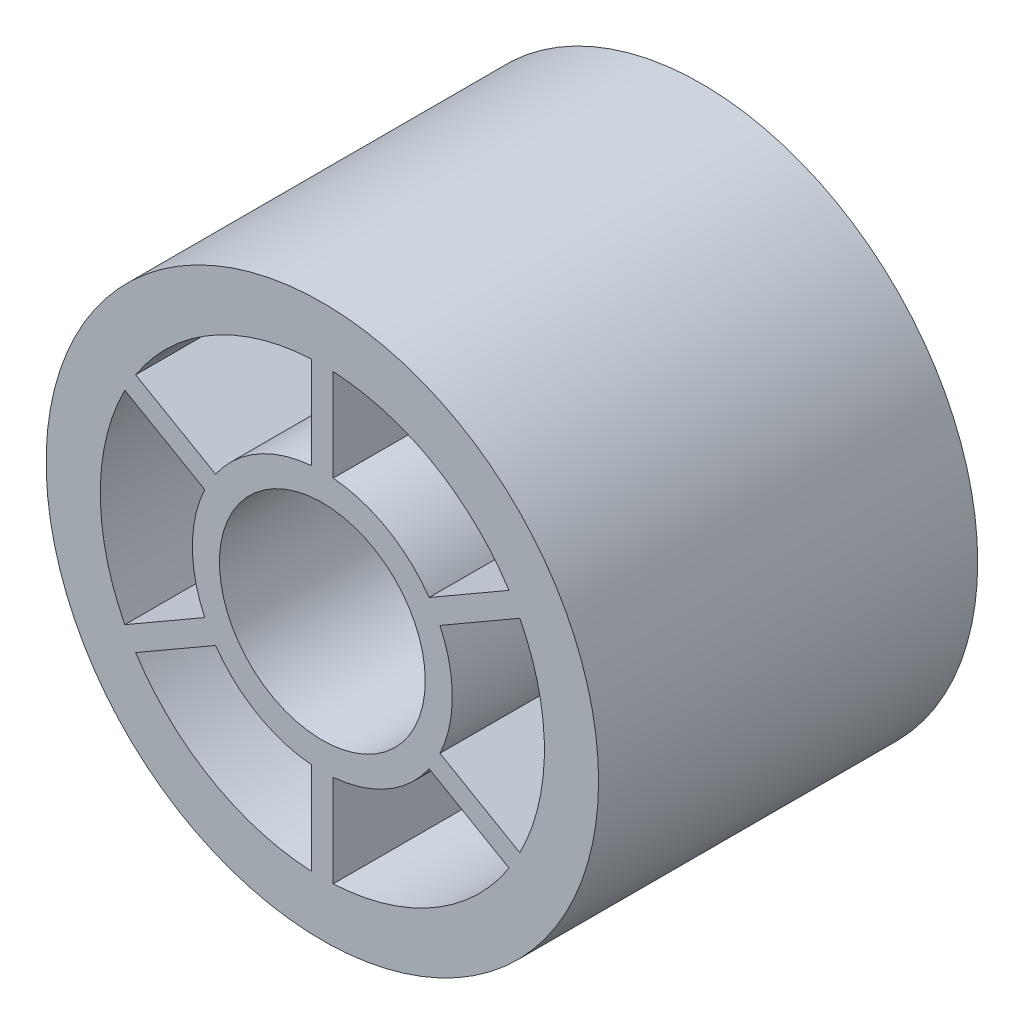
ISO-10303-21;
HEADER;
FILE_DESCRIPTION(('STEP AP214'),'2;1');
FILE_NAME('part.step','',(''),(''),'','','');
FILE_SCHEMA(('AUTOMOTIVE_DESIGN { 1 0 10303 214 1 1 1 1 }'));
ENDSEC;
DATA;
#1=APPLICATION_CONTEXT('core data for automotive mechanical design processes');
#2=APPLICATION_PROTOCOL_DEFINITION('international standard','automotive_design',2000,#1);
#3=PRODUCT_CONTEXT('',#1,'mechanical');
#4=PRODUCT('Part','Part','',(#3));
#5=PRODUCT_RELATED_PRODUCT_CATEGORY('part','',(#4));
#6=PRODUCT_DEFINITION_FORMATION('','',#4);
#7=PRODUCT_DEFINITION_CONTEXT('part definition',#1,'design');
#8=PRODUCT_DEFINITION('design','',#6,#7);
#9=PRODUCT_DEFINITION_SHAPE('','',#8);
#10=(LENGTH_UNIT() NAMED_UNIT(*) SI_UNIT(.MILLI.,.METRE.));
#11=(NAMED_UNIT(*) PLANE_ANGLE_UNIT() SI_UNIT($,.RADIAN.));
#12=(NAMED_UNIT(*) SI_UNIT($,.STERADIAN.) SOLID_ANGLE_UNIT());
#13=UNCERTAINTY_MEASURE_WITH_UNIT(LENGTH_MEASURE(1.E-05),#10,'distance_accuracy_value','');
#14=(GEOMETRIC_REPRESENTATION_CONTEXT(3) GLOBAL_UNCERTAINTY_ASSIGNED_CONTEXT((#13)) GLOBAL_UNIT_ASSIGNED_CONTEXT((#10,
#11,#12)) REPRESENTATION_CONTEXT('',''));
#15=CARTESIAN_POINT('',(0.,0.,0.));
#16=DIRECTION('',(0.,0.,1.));
#17=DIRECTION('',(1.,0.,0.));
#18=AXIS2_PLACEMENT_3D('',#15,#16,#17);
#19=CARTESIAN_POINT('',(0.,0.,35.));
#20=DIRECTION('',(0.,0.,1.));
#21=DIRECTION('',(1.,0.,0.));
#22=AXIS2_PLACEMENT_3D('',#19,#20,#21);
#23=PLANE('',#22);
#24=DIRECTION('',(-0.866025403784438,-0.5,0.));
#25=VECTOR('',#24,1.);
#26=CARTESIAN_POINT('',(-9.85615758860373,-6.84515577533552,35.));
#27=LINE('',#26,#25);
#28=CARTESIAN_POINT('',(-9.85615758860373,-6.84515577533552,35.));
#29=VERTEX_POINT('',#28);
#30=CARTESIAN_POINT('',(-17.2323856263051,-11.1038230185065,35.));
#31=VERTEX_POINT('',#30);
#32=EDGE_CURVE('E230',#29,#31,#27,.T.);
#33=ORIENTED_EDGE('',*,*,#32,.F.);
#34=CARTESIAN_POINT('',(0.,0.,35.));
#35=DIRECTION('',(0.,0.,-1.));
#36=DIRECTION('',(1.,0.,0.));
#37=AXIS2_PLACEMENT_3D('',#34,#35,#36);
#38=CIRCLE('',#37,12.);
#39=CARTESIAN_POINT('',(-1.00000000000008,-11.9582607431014,35.));
#40=VERTEX_POINT('',#39);
#41=EDGE_CURVE('E228',#40,#29,#38,.T.);
#42=ORIENTED_EDGE('',*,*,#41,.F.);
#43=DIRECTION('',(0.,1.,0.));
#44=VECTOR('',#43,1.);
#45=CARTESIAN_POINT('',(-1.00000000000008,-11.9582607431014,35.));
#46=LINE('',#45,#44);
#47=CARTESIAN_POINT('',(-1.00000000000014,-20.4755952294433,35.));
#48=VERTEX_POINT('',#47);
#49=EDGE_CURVE('E236',#48,#40,#46,.T.);
#50=ORIENTED_EDGE('',*,*,#49,.F.);
#51=CARTESIAN_POINT('',(0.,0.,35.));
#52=DIRECTION('',(0.,0.,1.));
#53=DIRECTION('',(1.,0.,0.));
#54=AXIS2_PLACEMENT_3D('',#51,#52,#53);
#55=CIRCLE('',#54,20.5);
#56=EDGE_CURVE('E233',#31,#48,#55,.T.);
#57=ORIENTED_EDGE('',*,*,#56,.F.);
#58=EDGE_LOOP('',(#33,#42,#50,#57));
#59=FACE_BOUND('',#58,.T.);
#60=DIRECTION('',(0.,1.,0.));
#61=VECTOR('',#60,1.);
#62=CARTESIAN_POINT('',(-1.,11.9582607431014,35.));
#63=LINE('',#62,#61);
#64=CARTESIAN_POINT('',(-1.,11.9582607431014,35.));
#65=VERTEX_POINT('',#64);
#66=CARTESIAN_POINT('',(-1.,20.4755952294433,35.));
#67=VERTEX_POINT('',#66);
#68=EDGE_CURVE('E292',#65,#67,#63,.T.);
#69=ORIENTED_EDGE('',*,*,#68,.F.);
#70=CARTESIAN_POINT('',(0.,0.,35.));
#71=DIRECTION('',(0.,0.,-1.));
#72=DIRECTION('',(1.,0.,0.));
#73=AXIS2_PLACEMENT_3D('',#70,#71,#72);
#74=CIRCLE('',#73,12.);
#75=CARTESIAN_POINT('',(-9.85615758860391,6.84515577533525,35.));
#76=VERTEX_POINT('',#75);
#77=EDGE_CURVE('E290',#76,#65,#74,.T.);
#78=ORIENTED_EDGE('',*,*,#77,.F.);
#79=DIRECTION('',(0.866025403784433,-0.50000000000001,0.));
#80=VECTOR('',#79,1.);
#81=CARTESIAN_POINT('',(-9.85615758860391,6.84515577533525,35.));
#82=LINE('',#81,#80);
#83=CARTESIAN_POINT('',(-17.2323856263052,11.1038230185063,35.));
#84=VERTEX_POINT('',#83);
#85=EDGE_CURVE('E298',#84,#76,#82,.T.);
#86=ORIENTED_EDGE('',*,*,#85,.F.);
#87=CARTESIAN_POINT('',(0.,0.,35.));
#88=DIRECTION('',(0.,0.,1.));
#89=DIRECTION('',(1.,0.,0.));
#90=AXIS2_PLACEMENT_3D('',#87,#88,#89);
#91=CIRCLE('',#90,20.5);
#92=EDGE_CURVE('E295',#67,#84,#91,.T.);
#93=ORIENTED_EDGE('',*,*,#92,.F.);
#94=EDGE_LOOP('',(#69,#78,#86,#93));
#95=FACE_BOUND('',#94,.T.);
#96=DIRECTION('',(0.86602540378444,0.499999999999998,0.));
#97=VECTOR('',#96,1.);
#98=CARTESIAN_POINT('',(9.85615758860401,6.84515577533512,35.));
#99=LINE('',#98,#97);
#100=CARTESIAN_POINT('',(9.85615758860401,6.84515577533512,35.));
#101=VERTEX_POINT('',#100);
#102=CARTESIAN_POINT('',(17.2323856263054,11.103823018506,35.));
#103=VERTEX_POINT('',#102);
#104=EDGE_CURVE('E354',#101,#103,#99,.T.);
#105=ORIENTED_EDGE('',*,*,#104,.F.);
#106=CARTESIAN_POINT('',(0.,0.,35.));
#107=DIRECTION('',(0.,0.,-1.));
#108=DIRECTION('',(1.,0.,0.));
#109=AXIS2_PLACEMENT_3D('',#106,#107,#108);
#110=CIRCLE('',#109,12.);
#111=CARTESIAN_POINT('',(1.,11.9582607431014,35.));
#112=VERTEX_POINT('',#111);
#113=EDGE_CURVE('E352',#112,#101,#110,.T.);
#114=ORIENTED_EDGE('',*,*,#113,.F.);
#115=DIRECTION('',(0.,-1.,0.));
#116=VECTOR('',#115,1.);
#117=CARTESIAN_POINT('',(1.,11.9582607431014,35.));
#118=LINE('',#117,#116);
#119=CARTESIAN_POINT('',(1.,20.4755952294433,35.));
#120=VERTEX_POINT('',#119);
#121=EDGE_CURVE('E360',#120,#112,#118,.T.);
#122=ORIENTED_EDGE('',*,*,#121,.F.);
#123=CARTESIAN_POINT('',(0.,0.,35.));
#124=DIRECTION('',(0.,0.,1.));
#125=DIRECTION('',(1.,0.,0.));
#126=AXIS2_PLACEMENT_3D('',#123,#124,#125);
#127=CIRCLE('',#126,20.5);
#128=EDGE_CURVE('E357',#103,#120,#127,.T.);
#129=ORIENTED_EDGE('',*,*,#128,.F.);
#130=EDGE_LOOP('',(#105,#114,#122,#129));
#131=FACE_BOUND('',#130,.T.);
#132=CARTESIAN_POINT('',(0.,0.,35.));
#133=DIRECTION('',(0.,0.,1.));
#134=DIRECTION('',(1.,0.,0.));
#135=AXIS2_PLACEMENT_3D('',#132,#133,#134);
#136=CIRCLE('',#135,25.5);
#137=CARTESIAN_POINT('',(25.5,0.,35.));
#138=VERTEX_POINT('',#137);
#139=EDGE_CURVE('E11',#138,#138,#136,.T.);
#140=ORIENTED_EDGE('',*,*,#139,.T.);
#141=EDGE_LOOP('',(#140));
#142=FACE_BOUND('',#141,.T.);
#143=CARTESIAN_POINT('',(0.,0.,35.));
#144=DIRECTION('',(0.,0.,1.));
#145=DIRECTION('',(1.,0.,0.));
#146=AXIS2_PLACEMENT_3D('',#143,#144,#145);
#147=CIRCLE('',#146,9.5);
#148=CARTESIAN_POINT('',(9.5,0.,35.));
#149=VERTEX_POINT('',#148);
#150=EDGE_CURVE('E383',#149,#149,#147,.T.);
#151=ORIENTED_EDGE('',*,*,#150,.F.);
#152=EDGE_LOOP('',(#151));
#153=FACE_BOUND('',#152,.T.);
#154=DIRECTION('',(0.866025403784461,-0.499999999999961,0.));
#155=VECTOR('',#154,1.);
#156=CARTESIAN_POINT('',(10.856157588604,-5.11310496776629,35.));
#157=LINE('',#156,#155);
#158=CARTESIAN_POINT('',(10.856157588604,-5.11310496776629,35.));
#159=VERTEX_POINT('',#158);
#160=CARTESIAN_POINT('',(18.2323856263057,-9.371772210937,35.));
#161=VERTEX_POINT('',#160);
#162=EDGE_CURVE('E323',#159,#161,#157,.T.);
#163=ORIENTED_EDGE('',*,*,#162,.F.);
#164=CARTESIAN_POINT('',(0.,0.,35.));
#165=DIRECTION('',(0.,0.,-1.));
#166=DIRECTION('',(1.,0.,0.));
#167=AXIS2_PLACEMENT_3D('',#164,#165,#166);
#168=CIRCLE('',#167,12.);
#169=CARTESIAN_POINT('',(10.856157588604,5.11310496776624,35.));
#170=VERTEX_POINT('',#169);
#171=EDGE_CURVE('E321',#170,#159,#168,.T.);
#172=ORIENTED_EDGE('',*,*,#171,.F.);
#173=DIRECTION('',(-0.86602540378444,-0.499999999999998,0.));
#174=VECTOR('',#173,1.);
#175=CARTESIAN_POINT('',(10.856157588604,5.11310496776624,35.));
#176=LINE('',#175,#174);
#177=CARTESIAN_POINT('',(18.2323856263054,9.37177221093715,35.));
#178=VERTEX_POINT('',#177);
#179=EDGE_CURVE('E329',#178,#170,#176,.T.);
#180=ORIENTED_EDGE('',*,*,#179,.F.);
#181=CARTESIAN_POINT('',(0.,0.,35.));
#182=DIRECTION('',(0.,0.,1.));
#183=DIRECTION('',(1.,0.,0.));
#184=AXIS2_PLACEMENT_3D('',#181,#182,#183);
#185=CIRCLE('',#184,20.5000000000002);
#186=EDGE_CURVE('E326',#161,#178,#185,.T.);
#187=ORIENTED_EDGE('',*,*,#186,.F.);
#188=EDGE_LOOP('',(#163,#172,#180,#187));
#189=FACE_BOUND('',#188,.T.);
#190=DIRECTION('',(0.,-1.,0.));
#191=VECTOR('',#190,1.);
#192=CARTESIAN_POINT('',(1.00000000000048,-11.9582607431016,35.));
#193=LINE('',#192,#191);
#194=CARTESIAN_POINT('',(1.00000000000048,-11.9582607431016,35.));
#195=VERTEX_POINT('',#194);
#196=CARTESIAN_POINT('',(1.00000000000047,-20.4755952294434,35.));
#197=VERTEX_POINT('',#196);
#198=EDGE_CURVE('E261',#195,#197,#193,.T.);
#199=ORIENTED_EDGE('',*,*,#198,.F.);
#200=CARTESIAN_POINT('',(0.,0.,35.));
#201=DIRECTION('',(0.,0.,-1.));
#202=DIRECTION('',(1.,0.,0.));
#203=AXIS2_PLACEMENT_3D('',#200,#201,#202);
#204=CIRCLE('',#203,12.0000000000001);
#205=CARTESIAN_POINT('',(9.85615758860396,-6.84515577533518,35.));
#206=VERTEX_POINT('',#205);
#207=EDGE_CURVE('E259',#206,#195,#204,.T.);
#208=ORIENTED_EDGE('',*,*,#207,.F.);
#209=DIRECTION('',(-0.866025403784436,0.500000000000004,0.));
#210=VECTOR('',#209,1.);
#211=CARTESIAN_POINT('',(9.85615758860396,-6.84515577533518,35.));
#212=LINE('',#211,#210);
#213=CARTESIAN_POINT('',(17.2323856263053,-11.1038230185062,35.));
#214=VERTEX_POINT('',#213);
#215=EDGE_CURVE('E267',#214,#206,#212,.T.);
#216=ORIENTED_EDGE('',*,*,#215,.F.);
#217=CARTESIAN_POINT('',(0.,0.,35.));
#218=DIRECTION('',(0.,0.,1.));
#219=DIRECTION('',(1.,0.,0.));
#220=AXIS2_PLACEMENT_3D('',#217,#218,#219);
#221=CIRCLE('',#220,20.5000000000001);
#222=EDGE_CURVE('E264',#197,#214,#221,.T.);
#223=ORIENTED_EDGE('',*,*,#222,.F.);
#224=EDGE_LOOP('',(#199,#208,#216,#223));
#225=FACE_BOUND('',#224,.T.);
#226=DIRECTION('',(-0.866025403784432,0.500000000000012,0.));
#227=VECTOR('',#226,1.);
#228=CARTESIAN_POINT('',(-10.8561575886042,5.11310496776585,35.));
#229=LINE('',#228,#227);
#230=CARTESIAN_POINT('',(-10.8561575886042,5.11310496776585,35.));
#231=VERTEX_POINT('',#230);
#232=CARTESIAN_POINT('',(-18.2323856263055,9.3717722109369,35.));
#233=VERTEX_POINT('',#232);
#234=EDGE_CURVE('E200',#231,#233,#229,.T.);
#235=ORIENTED_EDGE('',*,*,#234,.F.);
#236=CARTESIAN_POINT('',(0.,0.,35.));
#237=DIRECTION('',(0.,0.,-1.));
#238=DIRECTION('',(1.,0.,0.));
#239=AXIS2_PLACEMENT_3D('',#236,#237,#238);
#240=CIRCLE('',#239,12.);
#241=CARTESIAN_POINT('',(-10.856157588604,-5.11310496776616,35.));
#242=VERTEX_POINT('',#241);
#243=EDGE_CURVE('E192',#242,#231,#240,.T.);
#244=ORIENTED_EDGE('',*,*,#243,.F.);
#245=DIRECTION('',(0.866025403784443,0.499999999999992,0.));
#246=VECTOR('',#245,1.);
#247=CARTESIAN_POINT('',(-10.856157588604,-5.11310496776616,35.));
#248=LINE('',#247,#246);
#249=CARTESIAN_POINT('',(-18.2323856263054,-9.37177221093703,35.));
#250=VERTEX_POINT('',#249);
#251=EDGE_CURVE('E214',#250,#242,#248,.T.);
#252=ORIENTED_EDGE('',*,*,#251,.F.);
#253=CARTESIAN_POINT('',(0.,0.,35.));
#254=DIRECTION('',(0.,0.,1.));
#255=DIRECTION('',(1.,0.,0.));
#256=AXIS2_PLACEMENT_3D('',#253,#254,#255);
#257=CIRCLE('',#256,20.5);
#258=EDGE_CURVE('E212',#233,#250,#257,.T.);
#259=ORIENTED_EDGE('',*,*,#258,.F.);
#260=EDGE_LOOP('',(#235,#244,#252,#259));
#261=FACE_BOUND('',#260,.T.);
#262=ADVANCED_FACE('F31',(#59,#95,#131,#142,#153,#189,#225,#261),#23,.T.);
#263=CARTESIAN_POINT('',(0.,0.,0.));
#264=DIRECTION('',(0.,0.,1.));
#265=DIRECTION('',(1.,0.,0.));
#266=AXIS2_PLACEMENT_3D('',#263,#264,#265);
#267=PLANE('',#266);
#268=CARTESIAN_POINT('',(0.,0.,0.));
#269=DIRECTION('',(0.,0.,-1.));
#270=DIRECTION('',(1.,0.,0.));
#271=AXIS2_PLACEMENT_3D('',#268,#269,#270);
#272=CIRCLE('',#271,12.);
#273=CARTESIAN_POINT('',(-1.00000000000008,-11.9582607431014,0.));
#274=VERTEX_POINT('',#273);
#275=CARTESIAN_POINT('',(-9.85615758860373,-6.84515577533552,0.));
#276=VERTEX_POINT('',#275);
#277=EDGE_CURVE('E208',#274,#276,#272,.T.);
#278=ORIENTED_EDGE('',*,*,#277,.T.);
#279=DIRECTION('',(-0.866025403784438,-0.5,0.));
#280=VECTOR('',#279,1.);
#281=CARTESIAN_POINT('',(-9.85615758860373,-6.84515577533552,0.));
#282=LINE('',#281,#280);
#283=CARTESIAN_POINT('',(-17.2323856263051,-11.1038230185065,0.));
#284=VERTEX_POINT('',#283);
#285=EDGE_CURVE('E241',#276,#284,#282,.T.);
#286=ORIENTED_EDGE('',*,*,#285,.T.);
#287=CARTESIAN_POINT('',(0.,0.,0.));
#288=DIRECTION('',(0.,0.,1.));
#289=DIRECTION('',(1.,0.,0.));
#290=AXIS2_PLACEMENT_3D('',#287,#288,#289);
#291=CIRCLE('',#290,20.5);
#292=CARTESIAN_POINT('',(-1.00000000000014,-20.4755952294433,0.));
#293=VERTEX_POINT('',#292);
#294=EDGE_CURVE('E244',#284,#293,#291,.T.);
#295=ORIENTED_EDGE('',*,*,#294,.T.);
#296=DIRECTION('',(0.,1.,0.));
#297=VECTOR('',#296,1.);
#298=CARTESIAN_POINT('',(-1.00000000000008,-11.9582607431014,0.));
#299=LINE('',#298,#297);
#300=EDGE_CURVE('E231',#293,#274,#299,.T.);
#301=ORIENTED_EDGE('',*,*,#300,.T.);
#302=EDGE_LOOP('',(#278,#286,#295,#301));
#303=FACE_BOUND('',#302,.T.);
#304=CARTESIAN_POINT('',(0.,0.,0.));
#305=DIRECTION('',(0.,0.,-1.));
#306=DIRECTION('',(1.,0.,0.));
#307=AXIS2_PLACEMENT_3D('',#304,#305,#306);
#308=CIRCLE('',#307,12.);
#309=CARTESIAN_POINT('',(-9.85615758860391,6.84515577533525,0.));
#310=VERTEX_POINT('',#309);
#311=CARTESIAN_POINT('',(-1.,11.9582607431014,0.));
#312=VERTEX_POINT('',#311);
#313=EDGE_CURVE('E289',#310,#312,#308,.T.);
#314=ORIENTED_EDGE('',*,*,#313,.T.);
#315=DIRECTION('',(0.,1.,0.));
#316=VECTOR('',#315,1.);
#317=CARTESIAN_POINT('',(-1.,11.9582607431014,0.));
#318=LINE('',#317,#316);
#319=CARTESIAN_POINT('',(-1.,20.4755952294433,0.));
#320=VERTEX_POINT('',#319);
#321=EDGE_CURVE('E303',#312,#320,#318,.T.);
#322=ORIENTED_EDGE('',*,*,#321,.T.);
#323=CARTESIAN_POINT('',(0.,0.,0.));
#324=DIRECTION('',(0.,0.,1.));
#325=DIRECTION('',(1.,0.,0.));
#326=AXIS2_PLACEMENT_3D('',#323,#324,#325);
#327=CIRCLE('',#326,20.5);
#328=CARTESIAN_POINT('',(-17.2323856263052,11.1038230185063,0.));
#329=VERTEX_POINT('',#328);
#330=EDGE_CURVE('E306',#320,#329,#327,.T.);
#331=ORIENTED_EDGE('',*,*,#330,.T.);
#332=DIRECTION('',(0.866025403784433,-0.50000000000001,0.));
#333=VECTOR('',#332,1.);
#334=CARTESIAN_POINT('',(-9.85615758860391,6.84515577533525,0.));
#335=LINE('',#334,#333);
#336=EDGE_CURVE('E293',#329,#310,#335,.T.);
#337=ORIENTED_EDGE('',*,*,#336,.T.);
#338=EDGE_LOOP('',(#314,#322,#331,#337));
#339=FACE_BOUND('',#338,.T.);
#340=CARTESIAN_POINT('',(0.,0.,0.));
#341=DIRECTION('',(0.,0.,-1.));
#342=DIRECTION('',(1.,0.,0.));
#343=AXIS2_PLACEMENT_3D('',#340,#341,#342);
#344=CIRCLE('',#343,12.);
#345=CARTESIAN_POINT('',(1.,11.9582607431014,0.));
#346=VERTEX_POINT('',#345);
#347=CARTESIAN_POINT('',(9.85615758860401,6.84515577533512,0.));
#348=VERTEX_POINT('',#347);
#349=EDGE_CURVE('E351',#346,#348,#344,.T.);
#350=ORIENTED_EDGE('',*,*,#349,.T.);
#351=DIRECTION('',(0.86602540378444,0.499999999999998,0.));
#352=VECTOR('',#351,1.);
#353=CARTESIAN_POINT('',(9.85615758860401,6.84515577533512,0.));
#354=LINE('',#353,#352);
#355=CARTESIAN_POINT('',(17.2323856263054,11.103823018506,0.));
#356=VERTEX_POINT('',#355);
#357=EDGE_CURVE('E365',#348,#356,#354,.T.);
#358=ORIENTED_EDGE('',*,*,#357,.T.);
#359=CARTESIAN_POINT('',(0.,0.,0.));
#360=DIRECTION('',(0.,0.,1.));
#361=DIRECTION('',(1.,0.,0.));
#362=AXIS2_PLACEMENT_3D('',#359,#360,#361);
#363=CIRCLE('',#362,20.5);
#364=CARTESIAN_POINT('',(0.999999999999999,20.4755952294433,0.));
#365=VERTEX_POINT('',#364);
#366=EDGE_CURVE('E368',#356,#365,#363,.T.);
#367=ORIENTED_EDGE('',*,*,#366,.T.);
#368=DIRECTION('',(0.,-1.,0.));
#369=VECTOR('',#368,1.);
#370=CARTESIAN_POINT('',(1.,11.9582607431014,0.));
#371=LINE('',#370,#369);
#372=EDGE_CURVE('E355',#365,#346,#371,.T.);
#373=ORIENTED_EDGE('',*,*,#372,.T.);
#374=EDGE_LOOP('',(#350,#358,#367,#373));
#375=FACE_BOUND('',#374,.T.);
#376=CARTESIAN_POINT('',(0.,0.,0.));
#377=DIRECTION('',(0.,0.,1.));
#378=DIRECTION('',(1.,0.,0.));
#379=AXIS2_PLACEMENT_3D('',#376,#377,#378);
#380=CIRCLE('',#379,25.5);
#381=CARTESIAN_POINT('',(25.5,0.,0.));
#382=VERTEX_POINT('',#381);
#383=EDGE_CURVE('E35',#382,#382,#380,.T.);
#384=ORIENTED_EDGE('',*,*,#383,.F.);
#385=EDGE_LOOP('',(#384));
#386=FACE_BOUND('',#385,.T.);
#387=CARTESIAN_POINT('',(0.,0.,0.));
#388=DIRECTION('',(0.,0.,1.));
#389=DIRECTION('',(1.,0.,0.));
#390=AXIS2_PLACEMENT_3D('',#387,#388,#389);
#391=CIRCLE('',#390,9.5);
#392=CARTESIAN_POINT('',(9.5,0.,0.));
#393=VERTEX_POINT('',#392);
#394=EDGE_CURVE('E382',#393,#393,#391,.T.);
#395=ORIENTED_EDGE('',*,*,#394,.T.);
#396=EDGE_LOOP('',(#395));
#397=FACE_BOUND('',#396,.T.);
#398=CARTESIAN_POINT('',(0.,0.,0.));
#399=DIRECTION('',(0.,0.,-1.));
#400=DIRECTION('',(1.,0.,0.));
#401=AXIS2_PLACEMENT_3D('',#398,#399,#400);
#402=CIRCLE('',#401,12.);
#403=CARTESIAN_POINT('',(10.856157588604,5.11310496776624,0.));
#404=VERTEX_POINT('',#403);
#405=CARTESIAN_POINT('',(10.856157588604,-5.11310496776629,0.));
#406=VERTEX_POINT('',#405);
#407=EDGE_CURVE('E320',#404,#406,#402,.T.);
#408=ORIENTED_EDGE('',*,*,#407,.T.);
#409=DIRECTION('',(0.866025403784461,-0.499999999999961,0.));
#410=VECTOR('',#409,1.);
#411=CARTESIAN_POINT('',(10.856157588604,-5.11310496776629,0.));
#412=LINE('',#411,#410);
#413=CARTESIAN_POINT('',(18.2323856263057,-9.371772210937,0.));
#414=VERTEX_POINT('',#413);
#415=EDGE_CURVE('E334',#406,#414,#412,.T.);
#416=ORIENTED_EDGE('',*,*,#415,.T.);
#417=CARTESIAN_POINT('',(0.,0.,0.));
#418=DIRECTION('',(0.,0.,1.));
#419=DIRECTION('',(1.,0.,0.));
#420=AXIS2_PLACEMENT_3D('',#417,#418,#419);
#421=CIRCLE('',#420,20.5000000000002);
#422=CARTESIAN_POINT('',(18.2323856263054,9.37177221093715,0.));
#423=VERTEX_POINT('',#422);
#424=EDGE_CURVE('E337',#414,#423,#421,.T.);
#425=ORIENTED_EDGE('',*,*,#424,.T.);
#426=DIRECTION('',(-0.86602540378444,-0.499999999999998,0.));
#427=VECTOR('',#426,1.);
#428=CARTESIAN_POINT('',(10.856157588604,5.11310496776624,0.));
#429=LINE('',#428,#427);
#430=EDGE_CURVE('E324',#423,#404,#429,.T.);
#431=ORIENTED_EDGE('',*,*,#430,.T.);
#432=EDGE_LOOP('',(#408,#416,#425,#431));
#433=FACE_BOUND('',#432,.T.);
#434=CARTESIAN_POINT('',(0.,0.,0.));
#435=DIRECTION('',(0.,0.,-1.));
#436=DIRECTION('',(1.,0.,0.));
#437=AXIS2_PLACEMENT_3D('',#434,#435,#436);
#438=CIRCLE('',#437,12.0000000000001);
#439=CARTESIAN_POINT('',(9.85615758860396,-6.84515577533519,0.));
#440=VERTEX_POINT('',#439);
#441=CARTESIAN_POINT('',(1.00000000000048,-11.9582607431016,0.));
#442=VERTEX_POINT('',#441);
#443=EDGE_CURVE('E258',#440,#442,#438,.T.);
#444=ORIENTED_EDGE('',*,*,#443,.T.);
#445=DIRECTION('',(0.,-1.,0.));
#446=VECTOR('',#445,1.);
#447=CARTESIAN_POINT('',(1.00000000000048,-11.9582607431016,0.));
#448=LINE('',#447,#446);
#449=CARTESIAN_POINT('',(1.00000000000047,-20.4755952294434,0.));
#450=VERTEX_POINT('',#449);
#451=EDGE_CURVE('E272',#442,#450,#448,.T.);
#452=ORIENTED_EDGE('',*,*,#451,.T.);
#453=CARTESIAN_POINT('',(0.,0.,0.));
#454=DIRECTION('',(0.,0.,1.));
#455=DIRECTION('',(1.,0.,0.));
#456=AXIS2_PLACEMENT_3D('',#453,#454,#455);
#457=CIRCLE('',#456,20.5000000000001);
#458=CARTESIAN_POINT('',(17.2323856263053,-11.1038230185062,0.));
#459=VERTEX_POINT('',#458);
#460=EDGE_CURVE('E275',#450,#459,#457,.T.);
#461=ORIENTED_EDGE('',*,*,#460,.T.);
#462=DIRECTION('',(-0.866025403784436,0.500000000000004,0.));
#463=VECTOR('',#462,1.);
#464=CARTESIAN_POINT('',(9.85615758860396,-6.84515577533518,0.));
#465=LINE('',#464,#463);
#466=EDGE_CURVE('E262',#459,#440,#465,.T.);
#467=ORIENTED_EDGE('',*,*,#466,.T.);
#468=EDGE_LOOP('',(#444,#452,#461,#467));
#469=FACE_BOUND('',#468,.T.);
#470=CARTESIAN_POINT('',(0.,0.,0.));
#471=DIRECTION('',(0.,0.,-1.));
#472=DIRECTION('',(1.,0.,0.));
#473=AXIS2_PLACEMENT_3D('',#470,#471,#472);
#474=CIRCLE('',#473,12.);
#475=CARTESIAN_POINT('',(-10.856157588604,-5.11310496776616,0.));
#476=VERTEX_POINT('',#475);
#477=CARTESIAN_POINT('',(-10.8561575886042,5.11310496776585,0.));
#478=VERTEX_POINT('',#477);
#479=EDGE_CURVE('E54',#476,#478,#474,.T.);
#480=ORIENTED_EDGE('',*,*,#479,.T.);
#481=DIRECTION('',(-0.866025403784432,0.500000000000012,0.));
#482=VECTOR('',#481,1.);
#483=CARTESIAN_POINT('',(-10.8561575886042,5.11310496776585,0.));
#484=LINE('',#483,#482);
#485=CARTESIAN_POINT('',(-18.2323856263055,9.3717722109369,0.));
#486=VERTEX_POINT('',#485);
#487=EDGE_CURVE('E207',#478,#486,#484,.T.);
#488=ORIENTED_EDGE('',*,*,#487,.T.);
#489=CARTESIAN_POINT('',(0.,0.,0.));
#490=DIRECTION('',(0.,0.,1.));
#491=DIRECTION('',(1.,0.,0.));
#492=AXIS2_PLACEMENT_3D('',#489,#490,#491);
#493=CIRCLE('',#492,20.5);
#494=CARTESIAN_POINT('',(-18.2323856263054,-9.37177221093703,0.));
#495=VERTEX_POINT('',#494);
#496=EDGE_CURVE('E220',#486,#495,#493,.T.);
#497=ORIENTED_EDGE('',*,*,#496,.T.);
#498=DIRECTION('',(0.866025403784443,0.499999999999992,0.));
#499=VECTOR('',#498,1.);
#500=CARTESIAN_POINT('',(-10.856157588604,-5.11310496776616,0.));
#501=LINE('',#500,#499);
#502=EDGE_CURVE('E201',#495,#476,#501,.T.);
#503=ORIENTED_EDGE('',*,*,#502,.T.);
#504=EDGE_LOOP('',(#480,#488,#497,#503));
#505=FACE_BOUND('',#504,.T.);
#506=ADVANCED_FACE('F389',(#303,#339,#375,#386,#397,#433,#469,#505),#267,.F.);
#507=CARTESIAN_POINT('',(0.,0.,35.));
#508=DIRECTION('',(0.,0.,-1.));
#509=DIRECTION('',(-1.,0.,0.));
#510=AXIS2_PLACEMENT_3D('',#507,#508,#509);
#511=CYLINDRICAL_SURFACE('',#510,25.5);
#512=ORIENTED_EDGE('',*,*,#139,.F.);
#513=EDGE_LOOP('',(#512));
#514=FACE_BOUND('',#513,.T.);
#515=ORIENTED_EDGE('',*,*,#383,.T.);
#516=EDGE_LOOP('',(#515));
#517=FACE_BOUND('',#516,.T.);
#518=ADVANCED_FACE('F33',(#514,#517),#511,.T.);
#519=CARTESIAN_POINT('',(0.,0.,35.));
#520=DIRECTION('',(0.,0.,-1.));
#521=DIRECTION('',(-1.,0.,0.));
#522=AXIS2_PLACEMENT_3D('',#519,#520,#521);
#523=CYLINDRICAL_SURFACE('',#522,9.5);
#524=ORIENTED_EDGE('',*,*,#150,.T.);
#525=EDGE_LOOP('',(#524));
#526=FACE_BOUND('',#525,.T.);
#527=ORIENTED_EDGE('',*,*,#394,.F.);
#528=EDGE_LOOP('',(#527));
#529=FACE_BOUND('',#528,.T.);
#530=ADVANCED_FACE('F392',(#526,#529),#523,.F.);
#531=CARTESIAN_POINT('',(0.,0.,35.));
#532=DIRECTION('',(0.,0.,-1.));
#533=DIRECTION('',(-1.,0.,0.));
#534=AXIS2_PLACEMENT_3D('',#531,#532,#533);
#535=CYLINDRICAL_SURFACE('',#534,12.);
#536=ORIENTED_EDGE('',*,*,#349,.F.);
#537=DIRECTION('',(0.,0.,-1.));
#538=VECTOR('',#537,1.);
#539=CARTESIAN_POINT('',(1.,11.9582607431014,35.));
#540=LINE('',#539,#538);
#541=EDGE_CURVE('E362',#112,#346,#540,.T.);
#542=ORIENTED_EDGE('',*,*,#541,.F.);
#543=ORIENTED_EDGE('',*,*,#113,.T.);
#544=DIRECTION('',(0.,0.,-1.));
#545=VECTOR('',#544,1.);
#546=CARTESIAN_POINT('',(9.85615758860401,6.84515577533512,35.));
#547=LINE('',#546,#545);
#548=EDGE_CURVE('E379',#101,#348,#547,.T.);
#549=ORIENTED_EDGE('',*,*,#548,.T.);
#550=EDGE_LOOP('',(#536,#542,#543,#549));
#551=FACE_BOUND('',#550,.T.);
#552=ADVANCED_FACE('F394',(#551),#535,.T.);
#553=CARTESIAN_POINT('',(9.85615758860401,6.84515577533512,35.));
#554=DIRECTION('',(-0.499999999999998,0.86602540378444,0.));
#555=DIRECTION('',(-0.86602540378444,-0.499999999999998,0.));
#556=AXIS2_PLACEMENT_3D('',#553,#554,#555);
#557=PLANE('',#556);
#558=ORIENTED_EDGE('',*,*,#357,.F.);
#559=ORIENTED_EDGE('',*,*,#548,.F.);
#560=ORIENTED_EDGE('',*,*,#104,.T.);
#561=DIRECTION('',(0.,0.,-1.));
#562=VECTOR('',#561,1.);
#563=CARTESIAN_POINT('',(17.2323856263054,11.103823018506,35.));
#564=LINE('',#563,#562);
#565=EDGE_CURVE('E377',#103,#356,#564,.T.);
#566=ORIENTED_EDGE('',*,*,#565,.T.);
#567=EDGE_LOOP('',(#558,#559,#560,#566));
#568=FACE_BOUND('',#567,.T.);
#569=ADVANCED_FACE('F401',(#568),#557,.T.);
#570=CARTESIAN_POINT('',(0.,0.,35.));
#571=DIRECTION('',(0.,0.,-1.));
#572=DIRECTION('',(-1.,0.,0.));
#573=AXIS2_PLACEMENT_3D('',#570,#571,#572);
#574=CYLINDRICAL_SURFACE('',#573,20.5);
#575=ORIENTED_EDGE('',*,*,#366,.F.);
#576=ORIENTED_EDGE('',*,*,#565,.F.);
#577=ORIENTED_EDGE('',*,*,#128,.T.);
#578=DIRECTION('',(0.,0.,-1.));
#579=VECTOR('',#578,1.);
#580=CARTESIAN_POINT('',(0.999999999999999,20.4755952294433,35.));
#581=LINE('',#580,#579);
#582=EDGE_CURVE('E375',#120,#365,#581,.T.);
#583=ORIENTED_EDGE('',*,*,#582,.T.);
#584=EDGE_LOOP('',(#575,#576,#577,#583));
#585=FACE_BOUND('',#584,.T.);
#586=ADVANCED_FACE('F503',(#585),#574,.F.);
#587=CARTESIAN_POINT('',(1.,11.9582607431014,35.));
#588=DIRECTION('',(1.,0.,0.));
#589=DIRECTION('',(0.,0.,-1.));
#590=AXIS2_PLACEMENT_3D('',#587,#588,#589);
#591=PLANE('',#590);
#592=ORIENTED_EDGE('',*,*,#372,.F.);
#593=ORIENTED_EDGE('',*,*,#582,.F.);
#594=ORIENTED_EDGE('',*,*,#121,.T.);
#595=ORIENTED_EDGE('',*,*,#541,.T.);
#596=EDGE_LOOP('',(#592,#593,#594,#595));
#597=FACE_BOUND('',#596,.T.);
#598=ADVANCED_FACE('F499',(#597),#591,.T.);
#599=CARTESIAN_POINT('',(0.,0.,35.));
#600=DIRECTION('',(0.,0.,-1.));
#601=DIRECTION('',(-1.,0.,0.));
#602=AXIS2_PLACEMENT_3D('',#599,#600,#601);
#603=CYLINDRICAL_SURFACE('',#602,12.);
#604=ORIENTED_EDGE('',*,*,#407,.F.);
#605=DIRECTION('',(0.,0.,-1.));
#606=VECTOR('',#605,1.);
#607=CARTESIAN_POINT('',(10.856157588604,5.11310496776624,35.));
#608=LINE('',#607,#606);
#609=EDGE_CURVE('E331',#170,#404,#608,.T.);
#610=ORIENTED_EDGE('',*,*,#609,.F.);
#611=ORIENTED_EDGE('',*,*,#171,.T.);
#612=DIRECTION('',(0.,0.,-1.));
#613=VECTOR('',#612,1.);
#614=CARTESIAN_POINT('',(10.856157588604,-5.11310496776629,35.));
#615=LINE('',#614,#613);
#616=EDGE_CURVE('E348',#159,#406,#615,.T.);
#617=ORIENTED_EDGE('',*,*,#616,.T.);
#618=EDGE_LOOP('',(#604,#610,#611,#617));
#619=FACE_BOUND('',#618,.T.);
#620=ADVANCED_FACE('F495',(#619),#603,.T.);
#621=CARTESIAN_POINT('',(10.856157588604,-5.11310496776629,35.));
#622=DIRECTION('',(0.499999999999961,0.866025403784461,0.));
#623=DIRECTION('',(-0.866025403784461,0.499999999999961,0.));
#624=AXIS2_PLACEMENT_3D('',#621,#622,#623);
#625=PLANE('',#624);
#626=ORIENTED_EDGE('',*,*,#415,.F.);
#627=ORIENTED_EDGE('',*,*,#616,.F.);
#628=ORIENTED_EDGE('',*,*,#162,.T.);
#629=DIRECTION('',(0.,0.,-1.));
#630=VECTOR('',#629,1.);
#631=CARTESIAN_POINT('',(18.2323856263057,-9.371772210937,35.));
#632=LINE('',#631,#630);
#633=EDGE_CURVE('E346',#161,#414,#632,.T.);
#634=ORIENTED_EDGE('',*,*,#633,.T.);
#635=EDGE_LOOP('',(#626,#627,#628,#634));
#636=FACE_BOUND('',#635,.T.);
#637=ADVANCED_FACE('F491',(#636),#625,.T.);
#638=CARTESIAN_POINT('',(0.,0.,35.));
#639=DIRECTION('',(0.,0.,-1.));
#640=DIRECTION('',(-1.,0.,0.));
#641=AXIS2_PLACEMENT_3D('',#638,#639,#640);
#642=CYLINDRICAL_SURFACE('',#641,20.5000000000002);
#643=ORIENTED_EDGE('',*,*,#424,.F.);
#644=ORIENTED_EDGE('',*,*,#633,.F.);
#645=ORIENTED_EDGE('',*,*,#186,.T.);
#646=DIRECTION('',(0.,0.,-1.));
#647=VECTOR('',#646,1.);
#648=CARTESIAN_POINT('',(18.2323856263054,9.37177221093715,35.));
#649=LINE('',#648,#647);
#650=EDGE_CURVE('E344',#178,#423,#649,.T.);
#651=ORIENTED_EDGE('',*,*,#650,.T.);
#652=EDGE_LOOP('',(#643,#644,#645,#651));
#653=FACE_BOUND('',#652,.T.);
#654=ADVANCED_FACE('F487',(#653),#642,.F.);
#655=CARTESIAN_POINT('',(10.856157588604,5.11310496776624,35.));
#656=DIRECTION('',(0.499999999999998,-0.86602540378444,0.));
#657=DIRECTION('',(0.86602540378444,0.499999999999998,0.));
#658=AXIS2_PLACEMENT_3D('',#655,#656,#657);
#659=PLANE('',#658);
#660=ORIENTED_EDGE('',*,*,#430,.F.);
#661=ORIENTED_EDGE('',*,*,#650,.F.);
#662=ORIENTED_EDGE('',*,*,#179,.T.);
#663=ORIENTED_EDGE('',*,*,#609,.T.);
#664=EDGE_LOOP('',(#660,#661,#662,#663));
#665=FACE_BOUND('',#664,.T.);
#666=ADVANCED_FACE('F483',(#665),#659,.T.);
#667=CARTESIAN_POINT('',(0.,0.,35.));
#668=DIRECTION('',(0.,0.,-1.));
#669=DIRECTION('',(-1.,0.,0.));
#670=AXIS2_PLACEMENT_3D('',#667,#668,#669);
#671=CYLINDRICAL_SURFACE('',#670,12.);
#672=ORIENTED_EDGE('',*,*,#313,.F.);
#673=DIRECTION('',(0.,0.,-1.));
#674=VECTOR('',#673,1.);
#675=CARTESIAN_POINT('',(-9.85615758860391,6.84515577533525,35.));
#676=LINE('',#675,#674);
#677=EDGE_CURVE('E300',#76,#310,#676,.T.);
#678=ORIENTED_EDGE('',*,*,#677,.F.);
#679=ORIENTED_EDGE('',*,*,#77,.T.);
#680=DIRECTION('',(0.,0.,-1.));
#681=VECTOR('',#680,1.);
#682=CARTESIAN_POINT('',(-1.,11.9582607431014,35.));
#683=LINE('',#682,#681);
#684=EDGE_CURVE('E317',#65,#312,#683,.T.);
#685=ORIENTED_EDGE('',*,*,#684,.T.);
#686=EDGE_LOOP('',(#672,#678,#679,#685));
#687=FACE_BOUND('',#686,.T.);
#688=ADVANCED_FACE('F479',(#687),#671,.T.);
#689=CARTESIAN_POINT('',(-1.,11.9582607431014,35.));
#690=DIRECTION('',(-1.,0.,0.));
#691=DIRECTION('',(0.,0.,1.));
#692=AXIS2_PLACEMENT_3D('',#689,#690,#691);
#693=PLANE('',#692);
#694=ORIENTED_EDGE('',*,*,#321,.F.);
#695=ORIENTED_EDGE('',*,*,#684,.F.);
#696=ORIENTED_EDGE('',*,*,#68,.T.);
#697=DIRECTION('',(0.,0.,-1.));
#698=VECTOR('',#697,1.);
#699=CARTESIAN_POINT('',(-1.,20.4755952294433,35.));
#700=LINE('',#699,#698);
#701=EDGE_CURVE('E315',#67,#320,#700,.T.);
#702=ORIENTED_EDGE('',*,*,#701,.T.);
#703=EDGE_LOOP('',(#694,#695,#696,#702));
#704=FACE_BOUND('',#703,.T.);
#705=ADVANCED_FACE('F475',(#704),#693,.T.);
#706=CARTESIAN_POINT('',(0.,0.,35.));
#707=DIRECTION('',(0.,0.,-1.));
#708=DIRECTION('',(-1.,0.,0.));
#709=AXIS2_PLACEMENT_3D('',#706,#707,#708);
#710=CYLINDRICAL_SURFACE('',#709,20.5);
#711=ORIENTED_EDGE('',*,*,#330,.F.);
#712=ORIENTED_EDGE('',*,*,#701,.F.);
#713=ORIENTED_EDGE('',*,*,#92,.T.);
#714=DIRECTION('',(0.,0.,-1.));
#715=VECTOR('',#714,1.);
#716=CARTESIAN_POINT('',(-17.2323856263052,11.1038230185063,35.));
#717=LINE('',#716,#715);
#718=EDGE_CURVE('E313',#84,#329,#717,.T.);
#719=ORIENTED_EDGE('',*,*,#718,.T.);
#720=EDGE_LOOP('',(#711,#712,#713,#719));
#721=FACE_BOUND('',#720,.T.);
#722=ADVANCED_FACE('F471',(#721),#710,.F.);
#723=CARTESIAN_POINT('',(-9.85615758860391,6.84515577533525,35.));
#724=DIRECTION('',(0.50000000000001,0.866025403784433,0.));
#725=DIRECTION('',(-0.866025403784433,0.50000000000001,0.));
#726=AXIS2_PLACEMENT_3D('',#723,#724,#725);
#727=PLANE('',#726);
#728=ORIENTED_EDGE('',*,*,#336,.F.);
#729=ORIENTED_EDGE('',*,*,#718,.F.);
#730=ORIENTED_EDGE('',*,*,#85,.T.);
#731=ORIENTED_EDGE('',*,*,#677,.T.);
#732=EDGE_LOOP('',(#728,#729,#730,#731));
#733=FACE_BOUND('',#732,.T.);
#734=ADVANCED_FACE('F468',(#733),#727,.T.);
#735=CARTESIAN_POINT('',(0.,0.,35.));
#736=DIRECTION('',(0.,0.,-1.));
#737=DIRECTION('',(-1.,0.,0.));
#738=AXIS2_PLACEMENT_3D('',#735,#736,#737);
#739=CYLINDRICAL_SURFACE('',#738,12.0000000000001);
#740=ORIENTED_EDGE('',*,*,#443,.F.);
#741=DIRECTION('',(0.,0.,-1.));
#742=VECTOR('',#741,1.);
#743=CARTESIAN_POINT('',(9.85615758860396,-6.84515577533518,35.));
#744=LINE('',#743,#742);
#745=EDGE_CURVE('E269',#206,#440,#744,.T.);
#746=ORIENTED_EDGE('',*,*,#745,.F.);
#747=ORIENTED_EDGE('',*,*,#207,.T.);
#748=DIRECTION('',(0.,0.,-1.));
#749=VECTOR('',#748,1.);
#750=CARTESIAN_POINT('',(1.00000000000048,-11.9582607431016,35.));
#751=LINE('',#750,#749);
#752=EDGE_CURVE('E286',#195,#442,#751,.T.);
#753=ORIENTED_EDGE('',*,*,#752,.T.);
#754=EDGE_LOOP('',(#740,#746,#747,#753));
#755=FACE_BOUND('',#754,.T.);
#756=ADVANCED_FACE('F447',(#755),#739,.T.);
#757=CARTESIAN_POINT('',(1.00000000000048,-11.9582607431016,35.));
#758=DIRECTION('',(1.,0.,0.));
#759=DIRECTION('',(0.,1.,0.));
#760=AXIS2_PLACEMENT_3D('',#757,#758,#759);
#761=PLANE('',#760);
#762=ORIENTED_EDGE('',*,*,#451,.F.);
#763=ORIENTED_EDGE('',*,*,#752,.F.);
#764=ORIENTED_EDGE('',*,*,#198,.T.);
#765=DIRECTION('',(0.,0.,-1.));
#766=VECTOR('',#765,1.);
#767=CARTESIAN_POINT('',(1.00000000000047,-20.4755952294434,35.));
#768=LINE('',#767,#766);
#769=EDGE_CURVE('E284',#197,#450,#768,.T.);
#770=ORIENTED_EDGE('',*,*,#769,.T.);
#771=EDGE_LOOP('',(#762,#763,#764,#770));
#772=FACE_BOUND('',#771,.T.);
#773=ADVANCED_FACE('F439',(#772),#761,.T.);
#774=CARTESIAN_POINT('',(0.,0.,35.));
#775=DIRECTION('',(0.,0.,-1.));
#776=DIRECTION('',(-1.,0.,0.));
#777=AXIS2_PLACEMENT_3D('',#774,#775,#776);
#778=CYLINDRICAL_SURFACE('',#777,20.5000000000001);
#779=ORIENTED_EDGE('',*,*,#460,.F.);
#780=ORIENTED_EDGE('',*,*,#769,.F.);
#781=ORIENTED_EDGE('',*,*,#222,.T.);
#782=DIRECTION('',(0.,0.,-1.));
#783=VECTOR('',#782,1.);
#784=CARTESIAN_POINT('',(17.2323856263053,-11.1038230185062,35.));
#785=LINE('',#784,#783);
#786=EDGE_CURVE('E282',#214,#459,#785,.T.);
#787=ORIENTED_EDGE('',*,*,#786,.T.);
#788=EDGE_LOOP('',(#779,#780,#781,#787));
#789=FACE_BOUND('',#788,.T.);
#790=ADVANCED_FACE('F442',(#789),#778,.F.);
#791=CARTESIAN_POINT('',(9.85615758860396,-6.84515577533518,35.));
#792=DIRECTION('',(-0.500000000000004,-0.866025403784436,0.));
#793=DIRECTION('',(0.866025403784436,-0.500000000000004,0.));
#794=AXIS2_PLACEMENT_3D('',#791,#792,#793);
#795=PLANE('',#794);
#796=ORIENTED_EDGE('',*,*,#466,.F.);
#797=ORIENTED_EDGE('',*,*,#786,.F.);
#798=ORIENTED_EDGE('',*,*,#215,.T.);
#799=ORIENTED_EDGE('',*,*,#745,.T.);
#800=EDGE_LOOP('',(#796,#797,#798,#799));
#801=FACE_BOUND('',#800,.T.);
#802=ADVANCED_FACE('F450',(#801),#795,.T.);
#803=CARTESIAN_POINT('',(0.,0.,35.));
#804=DIRECTION('',(0.,0.,-1.));
#805=DIRECTION('',(-1.,0.,0.));
#806=AXIS2_PLACEMENT_3D('',#803,#804,#805);
#807=CYLINDRICAL_SURFACE('',#806,12.);
#808=ORIENTED_EDGE('',*,*,#277,.F.);
#809=DIRECTION('',(0.,0.,-1.));
#810=VECTOR('',#809,1.);
#811=CARTESIAN_POINT('',(-1.00000000000008,-11.9582607431014,35.));
#812=LINE('',#811,#810);
#813=EDGE_CURVE('E238',#40,#274,#812,.T.);
#814=ORIENTED_EDGE('',*,*,#813,.F.);
#815=ORIENTED_EDGE('',*,*,#41,.T.);
#816=DIRECTION('',(0.,0.,-1.));
#817=VECTOR('',#816,1.);
#818=CARTESIAN_POINT('',(-9.85615758860373,-6.84515577533552,35.));
#819=LINE('',#818,#817);
#820=EDGE_CURVE('E255',#29,#276,#819,.T.);
#821=ORIENTED_EDGE('',*,*,#820,.T.);
#822=EDGE_LOOP('',(#808,#814,#815,#821));
#823=FACE_BOUND('',#822,.T.);
#824=ADVANCED_FACE('F452',(#823),#807,.T.);
#825=CARTESIAN_POINT('',(-9.85615758860373,-6.84515577533552,35.));
#826=DIRECTION('',(0.5,-0.866025403784438,0.));
#827=DIRECTION('',(0.866025403784439,0.5,0.));
#828=AXIS2_PLACEMENT_3D('',#825,#826,#827);
#829=PLANE('',#828);
#830=ORIENTED_EDGE('',*,*,#285,.F.);
#831=ORIENTED_EDGE('',*,*,#820,.F.);
#832=ORIENTED_EDGE('',*,*,#32,.T.);
#833=DIRECTION('',(0.,0.,-1.));
#834=VECTOR('',#833,1.);
#835=CARTESIAN_POINT('',(-17.2323856263051,-11.1038230185065,35.));
#836=LINE('',#835,#834);
#837=EDGE_CURVE('E253',#31,#284,#836,.T.);
#838=ORIENTED_EDGE('',*,*,#837,.T.);
#839=EDGE_LOOP('',(#830,#831,#832,#838));
#840=FACE_BOUND('',#839,.T.);
#841=ADVANCED_FACE('F458',(#840),#829,.T.);
#842=CARTESIAN_POINT('',(0.,0.,35.));
#843=DIRECTION('',(0.,0.,-1.));
#844=DIRECTION('',(-1.,0.,0.));
#845=AXIS2_PLACEMENT_3D('',#842,#843,#844);
#846=CYLINDRICAL_SURFACE('',#845,20.5);
#847=ORIENTED_EDGE('',*,*,#294,.F.);
#848=ORIENTED_EDGE('',*,*,#837,.F.);
#849=ORIENTED_EDGE('',*,*,#56,.T.);
#850=DIRECTION('',(0.,0.,-1.));
#851=VECTOR('',#850,1.);
#852=CARTESIAN_POINT('',(-1.00000000000014,-20.4755952294433,35.));
#853=LINE('',#852,#851);
#854=EDGE_CURVE('E251',#48,#293,#853,.T.);
#855=ORIENTED_EDGE('',*,*,#854,.T.);
#856=EDGE_LOOP('',(#847,#848,#849,#855));
#857=FACE_BOUND('',#856,.T.);
#858=ADVANCED_FACE('F596',(#857),#846,.F.);
#859=CARTESIAN_POINT('',(-1.00000000000008,-11.9582607431014,35.));
#860=DIRECTION('',(-1.,0.,0.));
#861=DIRECTION('',(0.,-1.,0.));
#862=AXIS2_PLACEMENT_3D('',#859,#860,#861);
#863=PLANE('',#862);
#864=ORIENTED_EDGE('',*,*,#300,.F.);
#865=ORIENTED_EDGE('',*,*,#854,.F.);
#866=ORIENTED_EDGE('',*,*,#49,.T.);
#867=ORIENTED_EDGE('',*,*,#813,.T.);
#868=EDGE_LOOP('',(#864,#865,#866,#867));
#869=FACE_BOUND('',#868,.T.);
#870=ADVANCED_FACE('F605',(#869),#863,.T.);
#871=CARTESIAN_POINT('',(0.,0.,35.));
#872=DIRECTION('',(0.,0.,-1.));
#873=DIRECTION('',(-1.,0.,0.));
#874=AXIS2_PLACEMENT_3D('',#871,#872,#873);
#875=CYLINDRICAL_SURFACE('',#874,12.);
#876=ORIENTED_EDGE('',*,*,#479,.F.);
#877=DIRECTION('',(0.,0.,-1.));
#878=VECTOR('',#877,1.);
#879=CARTESIAN_POINT('',(-10.856157588604,-5.11310496776616,35.));
#880=LINE('',#879,#878);
#881=EDGE_CURVE('E196',#242,#476,#880,.T.);
#882=ORIENTED_EDGE('',*,*,#881,.F.);
#883=ORIENTED_EDGE('',*,*,#243,.T.);
#884=DIRECTION('',(0.,0.,-1.));
#885=VECTOR('',#884,1.);
#886=CARTESIAN_POINT('',(-10.8561575886042,5.11310496776585,35.));
#887=LINE('',#886,#885);
#888=EDGE_CURVE('E195',#231,#478,#887,.T.);
#889=ORIENTED_EDGE('',*,*,#888,.T.);
#890=EDGE_LOOP('',(#876,#882,#883,#889));
#891=FACE_BOUND('',#890,.T.);
#892=ADVANCED_FACE('F194',(#891),#875,.T.);
#893=CARTESIAN_POINT('',(-10.8561575886042,5.11310496776585,35.));
#894=DIRECTION('',(-0.500000000000012,-0.866025403784432,0.));
#895=DIRECTION('',(0.866025403784432,-0.500000000000012,0.));
#896=AXIS2_PLACEMENT_3D('',#893,#894,#895);
#897=PLANE('',#896);
#898=ORIENTED_EDGE('',*,*,#487,.F.);
#899=ORIENTED_EDGE('',*,*,#888,.F.);
#900=ORIENTED_EDGE('',*,*,#234,.T.);
#901=DIRECTION('',(0.,0.,-1.));
#902=VECTOR('',#901,1.);
#903=CARTESIAN_POINT('',(-18.2323856263055,9.3717722109369,35.));
#904=LINE('',#903,#902);
#905=EDGE_CURVE('E209',#233,#486,#904,.T.);
#906=ORIENTED_EDGE('',*,*,#905,.T.);
#907=EDGE_LOOP('',(#898,#899,#900,#906));
#908=FACE_BOUND('',#907,.T.);
#909=ADVANCED_FACE('F204',(#908),#897,.T.);
#910=CARTESIAN_POINT('',(0.,0.,35.));
#911=DIRECTION('',(0.,0.,-1.));
#912=DIRECTION('',(-1.,0.,0.));
#913=AXIS2_PLACEMENT_3D('',#910,#911,#912);
#914=CYLINDRICAL_SURFACE('',#913,20.5);
#915=ORIENTED_EDGE('',*,*,#496,.F.);
#916=ORIENTED_EDGE('',*,*,#905,.F.);
#917=ORIENTED_EDGE('',*,*,#258,.T.);
#918=DIRECTION('',(0.,0.,-1.));
#919=VECTOR('',#918,1.);
#920=CARTESIAN_POINT('',(-18.2323856263054,-9.37177221093703,35.));
#921=LINE('',#920,#919);
#922=EDGE_CURVE('E46',#250,#495,#921,.T.);
#923=ORIENTED_EDGE('',*,*,#922,.T.);
#924=EDGE_LOOP('',(#915,#916,#917,#923));
#925=FACE_BOUND('',#924,.T.);
#926=ADVANCED_FACE('F632',(#925),#914,.F.);
#927=CARTESIAN_POINT('',(-10.856157588604,-5.11310496776616,35.));
#928=DIRECTION('',(-0.499999999999992,0.866025403784443,0.));
#929=DIRECTION('',(-0.866025403784443,-0.499999999999992,0.));
#930=AXIS2_PLACEMENT_3D('',#927,#928,#929);
#931=PLANE('',#930);
#932=ORIENTED_EDGE('',*,*,#502,.F.);
#933=ORIENTED_EDGE('',*,*,#922,.F.);
#934=ORIENTED_EDGE('',*,*,#251,.T.);
#935=ORIENTED_EDGE('',*,*,#881,.T.);
#936=EDGE_LOOP('',(#932,#933,#934,#935));
#937=FACE_BOUND('',#936,.T.);
#938=ADVANCED_FACE('F641',(#937),#931,.T.);
#939=CLOSED_SHELL('',(#262,#506,#518,#530,#552,#569,#586,#598,#620,#637,#654,#666,#688,#705,
#722,#734,#756,#773,#790,#802,#824,#841,#858,#870,#892,#909,#926,#938));
#940=MANIFOLD_SOLID_BREP('B2',#939);
#941=ADVANCED_BREP_SHAPE_REPRESENTATION('',(#18,#940),#14);
#942=SHAPE_DEFINITION_REPRESENTATION(#9,#941);
ENDSEC;
END-ISO-10303-21;
